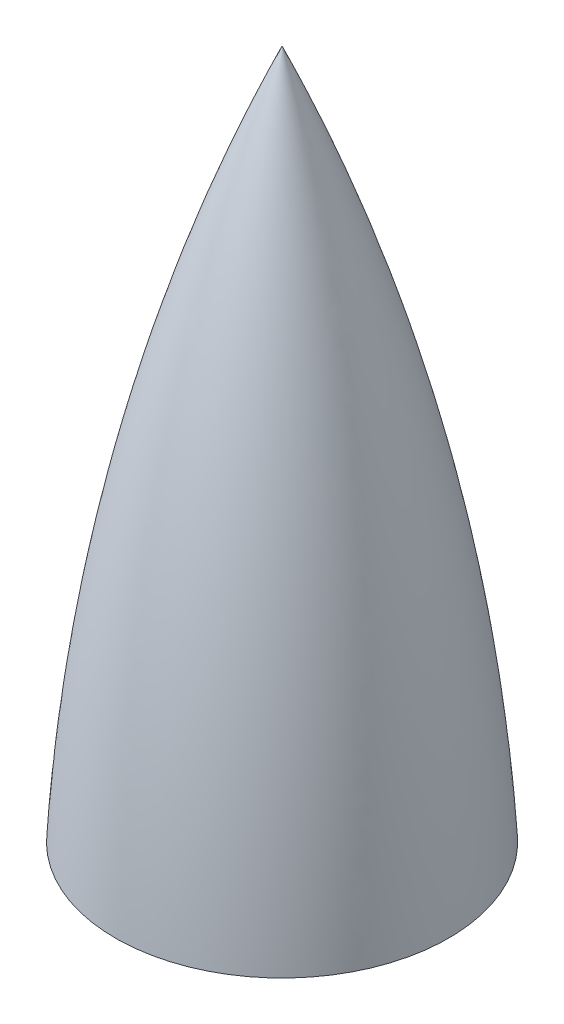
ISO-10303-21;
HEADER;
FILE_DESCRIPTION(('STEP AP214'),'2;1');
FILE_NAME('part.step','',(''),(''),'','','');
FILE_SCHEMA(('AUTOMOTIVE_DESIGN { 1 0 10303 214 1 1 1 1 }'));
ENDSEC;
DATA;
#1=APPLICATION_CONTEXT('core data for automotive mechanical design processes');
#2=APPLICATION_PROTOCOL_DEFINITION('international standard','automotive_design',2000,#1);
#3=PRODUCT_CONTEXT('',#1,'mechanical');
#4=PRODUCT('Part','Part','',(#3));
#5=PRODUCT_RELATED_PRODUCT_CATEGORY('part','',(#4));
#6=PRODUCT_DEFINITION_FORMATION('','',#4);
#7=PRODUCT_DEFINITION_CONTEXT('part definition',#1,'design');
#8=PRODUCT_DEFINITION('design','',#6,#7);
#9=PRODUCT_DEFINITION_SHAPE('','',#8);
#10=(LENGTH_UNIT() NAMED_UNIT(*) SI_UNIT(.MILLI.,.METRE.));
#11=(NAMED_UNIT(*) PLANE_ANGLE_UNIT() SI_UNIT($,.RADIAN.));
#12=(NAMED_UNIT(*) SI_UNIT($,.STERADIAN.) SOLID_ANGLE_UNIT());
#13=UNCERTAINTY_MEASURE_WITH_UNIT(LENGTH_MEASURE(1.E-05),#10,'distance_accuracy_value','');
#14=(GEOMETRIC_REPRESENTATION_CONTEXT(3) GLOBAL_UNCERTAINTY_ASSIGNED_CONTEXT((#13)) GLOBAL_UNIT_ASSIGNED_CONTEXT((#10,
#11,#12)) REPRESENTATION_CONTEXT('',''));
#15=CARTESIAN_POINT('',(0.,0.,0.));
#16=DIRECTION('',(0.,0.,1.));
#17=DIRECTION('',(1.,0.,0.));
#18=AXIS2_PLACEMENT_3D('',#15,#16,#17);
#19=CARTESIAN_POINT('',(999.516544803239,-62.1755608274495,0.));
#20=DIRECTION('',(0.,0.,-1.));
#21=DIRECTION('',(-1.,0.,0.));
#22=AXIS2_PLACEMENT_3D('',#19,#20,#21);
#23=CIRCLE('',#22,1093.36082838655);
#24=TRIMMED_CURVE('',#23,(PARAMETER_VALUE(-0.417343402761094)),
(PARAMETER_VALUE(0.417343402761094)),.T.,.PARAMETER.);
#25=CARTESIAN_POINT('',(-7.7715611723761E-13,-62.1755608274477,0.));
#26=DIRECTION('',(0.,1.,0.));
#27=AXIS1_PLACEMENT('',#25,#26);
#28=SURFACE_OF_REVOLUTION('',#24,#27);
#29=CARTESIAN_POINT('',(-6.53226602665202E-13,-1.66533453693773E-13,0.));
#30=DIRECTION('',(0.,1.,0.));
#31=DIRECTION('',(-1.,0.,0.));
#32=AXIS2_PLACEMENT_3D('',#29,#30,#31);
#33=CIRCLE('',#32,92.0749999999993);
#34=CARTESIAN_POINT('',(-92.075,0.,0.));
#35=VERTEX_POINT('',#34);
#36=EDGE_CURVE('E11',#35,#35,#33,.T.);
#37=ORIENTED_EDGE('',*,*,#36,.T.);
#38=EDGE_LOOP('',(#37));
#39=FACE_BOUND('',#38,.T.);
#40=CARTESIAN_POINT('',(0.,381.,0.));
#41=VERTEX_POINT('',#40);
#42=VERTEX_LOOP('',#41);
#43=FACE_BOUND('',#42,.T.);
#44=ADVANCED_FACE('F41',(#39,#43),#28,.T.);
#45=CARTESIAN_POINT('',(-92.075,-1.29117206663132E-13,0.));
#46=DIRECTION('',(0.,-1.,0.));
#47=DIRECTION('',(1.,0.,0.));
#48=AXIS2_PLACEMENT_3D('',#45,#46,#47);
#49=PLANE('',#48);
#50=CARTESIAN_POINT('',(-6.53226602665202E-13,-4.44089209850063E-13,0.));
#51=DIRECTION('',(0.,1.,0.));
#52=DIRECTION('',(-1.,0.,0.));
#53=AXIS2_PLACEMENT_3D('',#50,#51,#52);
#54=CIRCLE('',#53,88.8999999999993);
#55=CARTESIAN_POINT('',(-88.9,-2.91669669228183E-13,0.));
#56=VERTEX_POINT('',#55);
#57=EDGE_CURVE('E49',#56,#56,#54,.T.);
#58=ORIENTED_EDGE('',*,*,#57,.T.);
#59=EDGE_LOOP('',(#58));
#60=FACE_BOUND('',#59,.T.);
#61=ORIENTED_EDGE('',*,*,#36,.F.);
#62=EDGE_LOOP('',(#61));
#63=FACE_BOUND('',#62,.T.);
#64=ADVANCED_FACE('F58',(#60,#63),#49,.T.);
#65=CARTESIAN_POINT('',(1114.6957846476,-86.1623139369334,0.));
#66=DIRECTION('',(0.,0.,-1.));
#67=DIRECTION('',(-1.,0.,0.));
#68=AXIS2_PLACEMENT_3D('',#65,#66,#67);
#69=CIRCLE('',#68,1206.67591223346);
#70=TRIMMED_CURVE('',#69,(PARAMETER_VALUE(-0.392974866829419)),
(PARAMETER_VALUE(0.392974866829419)),.T.,.PARAMETER.);
#71=CARTESIAN_POINT('',(-8.88178419700125E-13,-86.1623139369315,0.));
#72=DIRECTION('',(0.,1.,0.));
#73=AXIS1_PLACEMENT('',#71,#72);
#74=SURFACE_OF_REVOLUTION('',#70,#73);
#75=CARTESIAN_POINT('',(0.,375.92,0.));
#76=VERTEX_POINT('',#75);
#77=VERTEX_LOOP('',#76);
#78=FACE_BOUND('',#77,.T.);
#79=ORIENTED_EDGE('',*,*,#57,.F.);
#80=EDGE_LOOP('',(#79));
#81=FACE_BOUND('',#80,.T.);
#82=ADVANCED_FACE('F55',(#78,#81),#74,.F.);
#83=CLOSED_SHELL('',(#44,#64,#82));
#84=MANIFOLD_SOLID_BREP('B2',#83);
#85=ADVANCED_BREP_SHAPE_REPRESENTATION('',(#18,#84),#14);
#86=SHAPE_DEFINITION_REPRESENTATION(#9,#85);
ENDSEC;
END-ISO-10303-21;
